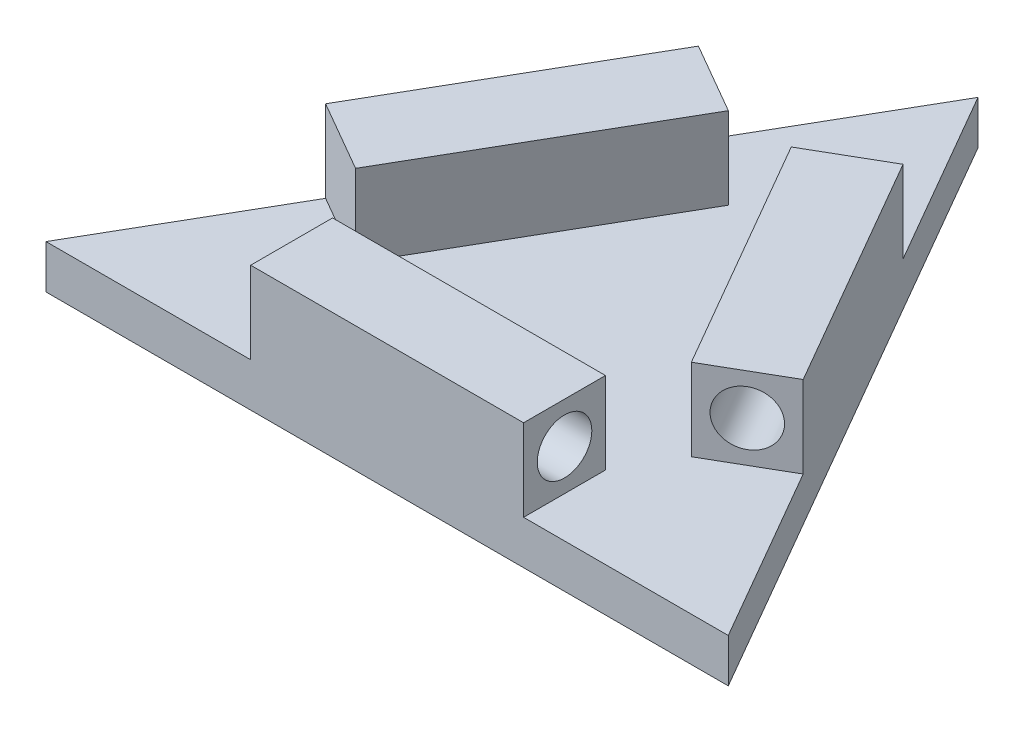
ISO-10303-21;
HEADER;
FILE_DESCRIPTION(('STEP AP214'),'2;1');
FILE_NAME('part.step','',(''),(''),'','','');
FILE_SCHEMA(('AUTOMOTIVE_DESIGN { 1 0 10303 214 1 1 1 1 }'));
ENDSEC;
DATA;
#1=APPLICATION_CONTEXT('core data for automotive mechanical design processes');
#2=APPLICATION_PROTOCOL_DEFINITION('international standard','automotive_design',2000,#1);
#3=PRODUCT_CONTEXT('',#1,'mechanical');
#4=PRODUCT('Part','Part','',(#3));
#5=PRODUCT_RELATED_PRODUCT_CATEGORY('part','',(#4));
#6=PRODUCT_DEFINITION_FORMATION('','',#4);
#7=PRODUCT_DEFINITION_CONTEXT('part definition',#1,'design');
#8=PRODUCT_DEFINITION('design','',#6,#7);
#9=PRODUCT_DEFINITION_SHAPE('','',#8);
#10=(LENGTH_UNIT() NAMED_UNIT(*) SI_UNIT(.MILLI.,.METRE.));
#11=(NAMED_UNIT(*) PLANE_ANGLE_UNIT() SI_UNIT($,.RADIAN.));
#12=(NAMED_UNIT(*) SI_UNIT($,.STERADIAN.) SOLID_ANGLE_UNIT());
#13=UNCERTAINTY_MEASURE_WITH_UNIT(LENGTH_MEASURE(1.E-05),#10,'distance_accuracy_value','');
#14=(GEOMETRIC_REPRESENTATION_CONTEXT(3) GLOBAL_UNCERTAINTY_ASSIGNED_CONTEXT((#13)) GLOBAL_UNIT_ASSIGNED_CONTEXT((#10,
#11,#12)) REPRESENTATION_CONTEXT('',''));
#15=CARTESIAN_POINT('',(0.,0.,0.));
#16=DIRECTION('',(0.,0.,1.));
#17=DIRECTION('',(1.,0.,0.));
#18=AXIS2_PLACEMENT_3D('',#15,#16,#17);
#19=CARTESIAN_POINT('',(0.,8.,-54.1265877365274));
#20=DIRECTION('',(0.866025403784439,0.,0.5));
#21=DIRECTION('',(0.5,0.,-0.866025403784439));
#22=AXIS2_PLACEMENT_3D('',#19,#20,#21);
#23=PLANE('',#22);
#24=DIRECTION('',(-0.5,0.,0.866025403784439));
#25=VECTOR('',#24,1.);
#26=CARTESIAN_POINT('',(0.,0.,-54.1265877365274));
#27=LINE('',#26,#25);
#28=CARTESIAN_POINT('',(0.,0.,-54.1265877365274));
#29=VERTEX_POINT('',#28);
#30=CARTESIAN_POINT('',(-62.5,0.,54.1265877365274));
#31=VERTEX_POINT('',#30);
#32=EDGE_CURVE('E238',#29,#31,#27,.T.);
#33=ORIENTED_EDGE('',*,*,#32,.T.);
#34=DIRECTION('',(0.,-1.,0.));
#35=VECTOR('',#34,1.);
#36=CARTESIAN_POINT('',(-62.5,8.,54.1265877365274));
#37=LINE('',#36,#35);
#38=CARTESIAN_POINT('',(-62.5,8.,54.1265877365274));
#39=VERTEX_POINT('',#38);
#40=EDGE_CURVE('E11',#39,#31,#37,.T.);
#41=ORIENTED_EDGE('',*,*,#40,.F.);
#42=DIRECTION('',(-0.5,0.,0.866025403784439));
#43=VECTOR('',#42,1.);
#44=CARTESIAN_POINT('',(0.,8.,-54.1265877365274));
#45=LINE('',#44,#43);
#46=CARTESIAN_POINT('',(-43.75,8.,21.650635094611));
#47=VERTEX_POINT('',#46);
#48=EDGE_CURVE('E242',#47,#39,#45,.T.);
#49=ORIENTED_EDGE('',*,*,#48,.F.);
#50=DIRECTION('',(0.,-1.,0.));
#51=VECTOR('',#50,1.);
#52=CARTESIAN_POINT('',(-43.75,23.,21.650635094611));
#53=LINE('',#52,#51);
#54=CARTESIAN_POINT('',(-43.75,23.,21.650635094611));
#55=VERTEX_POINT('',#54);
#56=EDGE_CURVE('E184',#55,#47,#53,.T.);
#57=ORIENTED_EDGE('',*,*,#56,.F.);
#58=DIRECTION('',(-0.5,0.,0.866025403784439));
#59=VECTOR('',#58,1.);
#60=CARTESIAN_POINT('',(-18.75,23.,-21.650635094611));
#61=LINE('',#60,#59);
#62=CARTESIAN_POINT('',(-18.75,23.,-21.650635094611));
#63=VERTEX_POINT('',#62);
#64=EDGE_CURVE('E200',#63,#55,#61,.T.);
#65=ORIENTED_EDGE('',*,*,#64,.F.);
#66=DIRECTION('',(0.,-1.,0.));
#67=VECTOR('',#66,1.);
#68=CARTESIAN_POINT('',(-18.75,23.,-21.650635094611));
#69=LINE('',#68,#67);
#70=CARTESIAN_POINT('',(-18.75,8.,-21.650635094611));
#71=VERTEX_POINT('',#70);
#72=EDGE_CURVE('E194',#63,#71,#69,.T.);
#73=ORIENTED_EDGE('',*,*,#72,.T.);
#74=CARTESIAN_POINT('',(0.,8.,-54.1265877365274));
#75=VERTEX_POINT('',#74);
#76=EDGE_CURVE('E239',#75,#71,#45,.T.);
#77=ORIENTED_EDGE('',*,*,#76,.F.);
#78=DIRECTION('',(0.,-1.,0.));
#79=VECTOR('',#78,1.);
#80=CARTESIAN_POINT('',(0.,8.,-54.1265877365274));
#81=LINE('',#80,#79);
#82=EDGE_CURVE('E248',#75,#29,#81,.T.);
#83=ORIENTED_EDGE('',*,*,#82,.T.);
#84=EDGE_LOOP('',(#33,#41,#49,#57,#65,#73,#77,#83));
#85=FACE_BOUND('',#84,.T.);
#86=ADVANCED_FACE('F41',(#85),#23,.F.);
#87=CARTESIAN_POINT('',(-62.5,8.,54.1265877365274));
#88=DIRECTION('',(0.,0.,-1.));
#89=DIRECTION('',(-1.,0.,0.));
#90=AXIS2_PLACEMENT_3D('',#87,#88,#89);
#91=PLANE('',#90);
#92=DIRECTION('',(1.,0.,0.));
#93=VECTOR('',#92,1.);
#94=CARTESIAN_POINT('',(-62.5,0.,54.1265877365274));
#95=LINE('',#94,#93);
#96=CARTESIAN_POINT('',(62.5,0.,54.1265877365274));
#97=VERTEX_POINT('',#96);
#98=EDGE_CURVE('E251',#31,#97,#95,.T.);
#99=ORIENTED_EDGE('',*,*,#98,.T.);
#100=DIRECTION('',(0.,-1.,0.));
#101=VECTOR('',#100,1.);
#102=CARTESIAN_POINT('',(62.5,8.,54.1265877365274));
#103=LINE('',#102,#101);
#104=CARTESIAN_POINT('',(62.5,8.,54.1265877365274));
#105=VERTEX_POINT('',#104);
#106=EDGE_CURVE('E48',#105,#97,#103,.T.);
#107=ORIENTED_EDGE('',*,*,#106,.F.);
#108=DIRECTION('',(1.,0.,0.));
#109=VECTOR('',#108,1.);
#110=CARTESIAN_POINT('',(-62.5,8.,54.1265877365274));
#111=LINE('',#110,#109);
#112=CARTESIAN_POINT('',(25.,8.,54.1265877365274));
#113=VERTEX_POINT('',#112);
#114=EDGE_CURVE('E241',#113,#105,#111,.T.);
#115=ORIENTED_EDGE('',*,*,#114,.F.);
#116=DIRECTION('',(0.,-1.,0.));
#117=VECTOR('',#116,1.);
#118=CARTESIAN_POINT('',(25.,23.,54.1265877365274));
#119=LINE('',#118,#117);
#120=CARTESIAN_POINT('',(25.,23.,54.1265877365274));
#121=VERTEX_POINT('',#120);
#122=EDGE_CURVE('E161',#121,#113,#119,.T.);
#123=ORIENTED_EDGE('',*,*,#122,.F.);
#124=DIRECTION('',(1.,0.,0.));
#125=VECTOR('',#124,1.);
#126=CARTESIAN_POINT('',(-25.,23.,54.1265877365274));
#127=LINE('',#126,#125);
#128=CARTESIAN_POINT('',(-25.,23.,54.1265877365274));
#129=VERTEX_POINT('',#128);
#130=EDGE_CURVE('E177',#129,#121,#127,.T.);
#131=ORIENTED_EDGE('',*,*,#130,.F.);
#132=DIRECTION('',(0.,-1.,0.));
#133=VECTOR('',#132,1.);
#134=CARTESIAN_POINT('',(-25.,23.,54.1265877365274));
#135=LINE('',#134,#133);
#136=CARTESIAN_POINT('',(-25.,8.,54.1265877365274));
#137=VERTEX_POINT('',#136);
#138=EDGE_CURVE('E168',#129,#137,#135,.T.);
#139=ORIENTED_EDGE('',*,*,#138,.T.);
#140=EDGE_CURVE('E243',#39,#137,#111,.T.);
#141=ORIENTED_EDGE('',*,*,#140,.F.);
#142=ORIENTED_EDGE('',*,*,#40,.T.);
#143=EDGE_LOOP('',(#99,#107,#115,#123,#131,#139,#141,#142));
#144=FACE_BOUND('',#143,.T.);
#145=ADVANCED_FACE('F299',(#144),#91,.F.);
#146=CARTESIAN_POINT('',(62.5,8.,54.1265877365274));
#147=DIRECTION('',(-0.866025403784439,0.,0.5));
#148=DIRECTION('',(0.5,0.,0.866025403784439));
#149=AXIS2_PLACEMENT_3D('',#146,#147,#148);
#150=PLANE('',#149);
#151=DIRECTION('',(-0.5,0.,-0.866025403784439));
#152=VECTOR('',#151,1.);
#153=CARTESIAN_POINT('',(62.5,0.,54.1265877365274));
#154=LINE('',#153,#152);
#155=EDGE_CURVE('E253',#97,#29,#154,.T.);
#156=ORIENTED_EDGE('',*,*,#155,.T.);
#157=ORIENTED_EDGE('',*,*,#82,.F.);
#158=DIRECTION('',(-0.5,0.,-0.866025403784439));
#159=VECTOR('',#158,1.);
#160=CARTESIAN_POINT('',(62.5,8.,54.1265877365274));
#161=LINE('',#160,#159);
#162=CARTESIAN_POINT('',(18.75,8.,-21.650635094611));
#163=VERTEX_POINT('',#162);
#164=EDGE_CURVE('E245',#163,#75,#161,.T.);
#165=ORIENTED_EDGE('',*,*,#164,.F.);
#166=DIRECTION('',(0.,-1.,0.));
#167=VECTOR('',#166,1.);
#168=CARTESIAN_POINT('',(18.75,23.,-21.650635094611));
#169=LINE('',#168,#167);
#170=CARTESIAN_POINT('',(18.75,23.,-21.650635094611));
#171=VERTEX_POINT('',#170);
#172=EDGE_CURVE('E235',#171,#163,#169,.T.);
#173=ORIENTED_EDGE('',*,*,#172,.F.);
#174=DIRECTION('',(-0.5,0.,-0.866025403784439));
#175=VECTOR('',#174,1.);
#176=CARTESIAN_POINT('',(43.75,23.,21.650635094611));
#177=LINE('',#176,#175);
#178=CARTESIAN_POINT('',(43.75,23.,21.650635094611));
#179=VERTEX_POINT('',#178);
#180=EDGE_CURVE('E210',#179,#171,#177,.T.);
#181=ORIENTED_EDGE('',*,*,#180,.F.);
#182=DIRECTION('',(0.,-1.,0.));
#183=VECTOR('',#182,1.);
#184=CARTESIAN_POINT('',(43.75,23.,21.650635094611));
#185=LINE('',#184,#183);
#186=CARTESIAN_POINT('',(43.75,8.,21.650635094611));
#187=VERTEX_POINT('',#186);
#188=EDGE_CURVE('E219',#179,#187,#185,.T.);
#189=ORIENTED_EDGE('',*,*,#188,.T.);
#190=EDGE_CURVE('E246',#105,#187,#161,.T.);
#191=ORIENTED_EDGE('',*,*,#190,.F.);
#192=ORIENTED_EDGE('',*,*,#106,.T.);
#193=EDGE_LOOP('',(#156,#157,#165,#173,#181,#189,#191,#192));
#194=FACE_BOUND('',#193,.T.);
#195=ADVANCED_FACE('F261',(#194),#150,.F.);
#196=CARTESIAN_POINT('',(0.,8.,0.));
#197=DIRECTION('',(0.,1.,0.));
#198=DIRECTION('',(0.,0.,1.));
#199=AXIS2_PLACEMENT_3D('',#196,#197,#198);
#200=PLANE('',#199);
#201=DIRECTION('',(-0.866025403784438,0.,-0.5));
#202=VECTOR('',#201,1.);
#203=CARTESIAN_POINT('',(-5.75961894323342,8.,-14.150635094611));
#204=LINE('',#203,#202);
#205=CARTESIAN_POINT('',(-5.75961894323342,8.,-14.150635094611));
#206=VERTEX_POINT('',#205);
#207=EDGE_CURVE('E55',#206,#71,#204,.T.);
#208=ORIENTED_EDGE('',*,*,#207,.F.);
#209=DIRECTION('',(0.5,0.,-0.866025403784439));
#210=VECTOR('',#209,1.);
#211=CARTESIAN_POINT('',(-30.7596189432334,8.,29.150635094611));
#212=LINE('',#211,#210);
#213=CARTESIAN_POINT('',(-30.7596189432334,8.,29.150635094611));
#214=VERTEX_POINT('',#213);
#215=EDGE_CURVE('E199',#214,#206,#212,.T.);
#216=ORIENTED_EDGE('',*,*,#215,.F.);
#217=DIRECTION('',(0.866025403784439,0.,0.5));
#218=VECTOR('',#217,1.);
#219=CARTESIAN_POINT('',(-43.75,8.,21.650635094611));
#220=LINE('',#219,#218);
#221=EDGE_CURVE('E170',#47,#214,#220,.T.);
#222=ORIENTED_EDGE('',*,*,#221,.F.);
#223=ORIENTED_EDGE('',*,*,#48,.T.);
#224=ORIENTED_EDGE('',*,*,#140,.T.);
#225=DIRECTION('',(0.,0.,1.));
#226=VECTOR('',#225,1.);
#227=CARTESIAN_POINT('',(-25.,8.,39.1265877365274));
#228=LINE('',#227,#226);
#229=CARTESIAN_POINT('',(-25.,8.,39.1265877365274));
#230=VERTEX_POINT('',#229);
#231=EDGE_CURVE('E62',#230,#137,#228,.T.);
#232=ORIENTED_EDGE('',*,*,#231,.F.);
#233=DIRECTION('',(-1.,0.,0.));
#234=VECTOR('',#233,1.);
#235=CARTESIAN_POINT('',(25.,8.,39.1265877365274));
#236=LINE('',#235,#234);
#237=CARTESIAN_POINT('',(25.,8.,39.1265877365274));
#238=VERTEX_POINT('',#237);
#239=EDGE_CURVE('E143',#238,#230,#236,.T.);
#240=ORIENTED_EDGE('',*,*,#239,.F.);
#241=DIRECTION('',(0.,0.,-1.));
#242=VECTOR('',#241,1.);
#243=CARTESIAN_POINT('',(25.,8.,54.1265877365274));
#244=LINE('',#243,#242);
#245=EDGE_CURVE('E146',#113,#238,#244,.T.);
#246=ORIENTED_EDGE('',*,*,#245,.F.);
#247=ORIENTED_EDGE('',*,*,#114,.T.);
#248=ORIENTED_EDGE('',*,*,#190,.T.);
#249=DIRECTION('',(0.866025403784439,0.,-0.5));
#250=VECTOR('',#249,1.);
#251=CARTESIAN_POINT('',(30.7596189432334,8.,29.150635094611));
#252=LINE('',#251,#250);
#253=CARTESIAN_POINT('',(30.7596189432334,8.,29.150635094611));
#254=VERTEX_POINT('',#253);
#255=EDGE_CURVE('E213',#254,#187,#252,.T.);
#256=ORIENTED_EDGE('',*,*,#255,.F.);
#257=DIRECTION('',(0.5,0.,0.866025403784438));
#258=VECTOR('',#257,1.);
#259=CARTESIAN_POINT('',(5.75961894323342,8.,-14.150635094611));
#260=LINE('',#259,#258);
#261=CARTESIAN_POINT('',(5.75961894323342,8.,-14.150635094611));
#262=VERTEX_POINT('',#261);
#263=EDGE_CURVE('E222',#262,#254,#260,.T.);
#264=ORIENTED_EDGE('',*,*,#263,.F.);
#265=DIRECTION('',(-0.866025403784439,0.,0.5));
#266=VECTOR('',#265,1.);
#267=CARTESIAN_POINT('',(18.75,8.,-21.650635094611));
#268=LINE('',#267,#266);
#269=EDGE_CURVE('E162',#163,#262,#268,.T.);
#270=ORIENTED_EDGE('',*,*,#269,.F.);
#271=ORIENTED_EDGE('',*,*,#164,.T.);
#272=ORIENTED_EDGE('',*,*,#76,.T.);
#273=EDGE_LOOP('',(#208,#216,#222,#223,#224,#232,#240,#246,#247,#248,#256,#264,#270,#271,#272));
#274=FACE_BOUND('',#273,.T.);
#275=ADVANCED_FACE('F145',(#274),#200,.T.);
#276=CARTESIAN_POINT('',(0.,0.,0.));
#277=DIRECTION('',(0.,1.,0.));
#278=DIRECTION('',(0.,0.,1.));
#279=AXIS2_PLACEMENT_3D('',#276,#277,#278);
#280=PLANE('',#279);
#281=ORIENTED_EDGE('',*,*,#32,.F.);
#282=ORIENTED_EDGE('',*,*,#155,.F.);
#283=ORIENTED_EDGE('',*,*,#98,.F.);
#284=EDGE_LOOP('',(#281,#282,#283));
#285=FACE_BOUND('',#284,.T.);
#286=ADVANCED_FACE('F266',(#285),#280,.F.);
#287=CARTESIAN_POINT('',(18.75,23.,-21.650635094611));
#288=DIRECTION('',(0.5,0.,0.866025403784439));
#289=DIRECTION('',(0.866025403784439,0.,-0.5));
#290=AXIS2_PLACEMENT_3D('',#287,#288,#289);
#291=PLANE('',#290);
#292=ORIENTED_EDGE('',*,*,#269,.T.);
#293=DIRECTION('',(0.,-1.,0.));
#294=VECTOR('',#293,1.);
#295=CARTESIAN_POINT('',(5.75961894323342,23.,-14.150635094611));
#296=LINE('',#295,#294);
#297=CARTESIAN_POINT('',(5.75961894323342,23.,-14.150635094611));
#298=VERTEX_POINT('',#297);
#299=EDGE_CURVE('E232',#298,#262,#296,.T.);
#300=ORIENTED_EDGE('',*,*,#299,.F.);
#301=DIRECTION('',(-0.866025403784439,0.,0.5));
#302=VECTOR('',#301,1.);
#303=CARTESIAN_POINT('',(18.75,23.,-21.650635094611));
#304=LINE('',#303,#302);
#305=EDGE_CURVE('E212',#171,#298,#304,.T.);
#306=ORIENTED_EDGE('',*,*,#305,.F.);
#307=ORIENTED_EDGE('',*,*,#172,.T.);
#308=EDGE_LOOP('',(#292,#300,#306,#307));
#309=FACE_BOUND('',#308,.T.);
#310=ADVANCED_FACE('F276',(#309),#291,.F.);
#311=CARTESIAN_POINT('',(5.75961894323342,23.,-14.150635094611));
#312=DIRECTION('',(0.866025403784438,0.,-0.5));
#313=DIRECTION('',(-0.5,0.,-0.866025403784439));
#314=AXIS2_PLACEMENT_3D('',#311,#312,#313);
#315=PLANE('',#314);
#316=ORIENTED_EDGE('',*,*,#263,.T.);
#317=DIRECTION('',(0.,-1.,0.));
#318=VECTOR('',#317,1.);
#319=CARTESIAN_POINT('',(30.7596189432334,23.,29.150635094611));
#320=LINE('',#319,#318);
#321=CARTESIAN_POINT('',(30.7596189432334,23.,29.150635094611));
#322=VERTEX_POINT('',#321);
#323=EDGE_CURVE('E229',#322,#254,#320,.T.);
#324=ORIENTED_EDGE('',*,*,#323,.F.);
#325=DIRECTION('',(0.5,0.,0.866025403784438));
#326=VECTOR('',#325,1.);
#327=CARTESIAN_POINT('',(5.75961894323342,23.,-14.150635094611));
#328=LINE('',#327,#326);
#329=EDGE_CURVE('E215',#298,#322,#328,.T.);
#330=ORIENTED_EDGE('',*,*,#329,.F.);
#331=ORIENTED_EDGE('',*,*,#299,.T.);
#332=EDGE_LOOP('',(#316,#324,#330,#331));
#333=FACE_BOUND('',#332,.T.);
#334=ADVANCED_FACE('F287',(#333),#315,.F.);
#335=CARTESIAN_POINT('',(30.7596189432334,23.,29.150635094611));
#336=DIRECTION('',(-0.5,0.,-0.866025403784439));
#337=DIRECTION('',(-0.866025403784439,0.,0.5));
#338=AXIS2_PLACEMENT_3D('',#335,#336,#337);
#339=PLANE('',#338);
#340=CARTESIAN_POINT('',(37.2548094716167,15.5,25.400635094611));
#341=DIRECTION('',(0.5,0.,0.866025403784439));
#342=DIRECTION('',(0.866025403784439,0.,-0.5));
#343=AXIS2_PLACEMENT_3D('',#340,#341,#342);
#344=CIRCLE('',#343,5.);
#345=CARTESIAN_POINT('',(41.5849364905389,15.5,22.900635094611));
#346=VERTEX_POINT('',#345);
#347=EDGE_CURVE('E487',#346,#346,#344,.T.);
#348=ORIENTED_EDGE('',*,*,#347,.F.);
#349=EDGE_LOOP('',(#348));
#350=FACE_BOUND('',#349,.T.);
#351=ORIENTED_EDGE('',*,*,#255,.T.);
#352=ORIENTED_EDGE('',*,*,#188,.F.);
#353=DIRECTION('',(0.866025403784439,0.,-0.5));
#354=VECTOR('',#353,1.);
#355=CARTESIAN_POINT('',(30.7596189432334,23.,29.150635094611));
#356=LINE('',#355,#354);
#357=EDGE_CURVE('E217',#322,#179,#356,.T.);
#358=ORIENTED_EDGE('',*,*,#357,.F.);
#359=ORIENTED_EDGE('',*,*,#323,.T.);
#360=EDGE_LOOP('',(#351,#352,#358,#359));
#361=FACE_BOUND('',#360,.T.);
#362=ADVANCED_FACE('F285',(#350,#361),#339,.F.);
#363=CARTESIAN_POINT('',(0.,23.,0.));
#364=DIRECTION('',(0.,1.,0.));
#365=DIRECTION('',(0.,0.,1.));
#366=AXIS2_PLACEMENT_3D('',#363,#364,#365);
#367=PLANE('',#366);
#368=ORIENTED_EDGE('',*,*,#180,.T.);
#369=ORIENTED_EDGE('',*,*,#305,.T.);
#370=ORIENTED_EDGE('',*,*,#329,.T.);
#371=ORIENTED_EDGE('',*,*,#357,.T.);
#372=EDGE_LOOP('',(#368,#369,#370,#371));
#373=FACE_BOUND('',#372,.T.);
#374=ADVANCED_FACE('F280',(#373),#367,.T.);
#375=CARTESIAN_POINT('',(25.,23.,54.1265877365274));
#376=DIRECTION('',(-1.,0.,0.));
#377=DIRECTION('',(0.,0.,1.));
#378=AXIS2_PLACEMENT_3D('',#375,#376,#377);
#379=PLANE('',#378);
#380=CARTESIAN_POINT('',(25.,15.5,46.6265877365274));
#381=DIRECTION('',(1.,0.,0.));
#382=DIRECTION('',(0.,0.,-1.));
#383=AXIS2_PLACEMENT_3D('',#380,#381,#382);
#384=CIRCLE('',#383,5.);
#385=CARTESIAN_POINT('',(25.,15.5,41.6265877365274));
#386=VERTEX_POINT('',#385);
#387=EDGE_CURVE('E497',#386,#386,#384,.T.);
#388=ORIENTED_EDGE('',*,*,#387,.F.);
#389=EDGE_LOOP('',(#388));
#390=FACE_BOUND('',#389,.T.);
#391=ORIENTED_EDGE('',*,*,#245,.T.);
#392=DIRECTION('',(0.,-1.,0.));
#393=VECTOR('',#392,1.);
#394=CARTESIAN_POINT('',(25.,23.,39.1265877365274));
#395=LINE('',#394,#393);
#396=CARTESIAN_POINT('',(25.,23.,39.1265877365274));
#397=VERTEX_POINT('',#396);
#398=EDGE_CURVE('E158',#397,#238,#395,.T.);
#399=ORIENTED_EDGE('',*,*,#398,.F.);
#400=DIRECTION('',(0.,0.,-1.));
#401=VECTOR('',#400,1.);
#402=CARTESIAN_POINT('',(25.,23.,54.1265877365274));
#403=LINE('',#402,#401);
#404=EDGE_CURVE('E181',#121,#397,#403,.T.);
#405=ORIENTED_EDGE('',*,*,#404,.F.);
#406=ORIENTED_EDGE('',*,*,#122,.T.);
#407=EDGE_LOOP('',(#391,#399,#405,#406));
#408=FACE_BOUND('',#407,.T.);
#409=ADVANCED_FACE('F156',(#390,#408),#379,.F.);
#410=CARTESIAN_POINT('',(25.,23.,39.1265877365274));
#411=DIRECTION('',(0.,0.,1.));
#412=DIRECTION('',(1.,0.,0.));
#413=AXIS2_PLACEMENT_3D('',#410,#411,#412);
#414=PLANE('',#413);
#415=ORIENTED_EDGE('',*,*,#239,.T.);
#416=DIRECTION('',(0.,-1.,0.));
#417=VECTOR('',#416,1.);
#418=CARTESIAN_POINT('',(-25.,23.,39.1265877365274));
#419=LINE('',#418,#417);
#420=CARTESIAN_POINT('',(-25.,23.,39.1265877365274));
#421=VERTEX_POINT('',#420);
#422=EDGE_CURVE('E166',#421,#230,#419,.T.);
#423=ORIENTED_EDGE('',*,*,#422,.F.);
#424=DIRECTION('',(-1.,0.,0.));
#425=VECTOR('',#424,1.);
#426=CARTESIAN_POINT('',(25.,23.,39.1265877365274));
#427=LINE('',#426,#425);
#428=EDGE_CURVE('E165',#397,#421,#427,.T.);
#429=ORIENTED_EDGE('',*,*,#428,.F.);
#430=ORIENTED_EDGE('',*,*,#398,.T.);
#431=EDGE_LOOP('',(#415,#423,#429,#430));
#432=FACE_BOUND('',#431,.T.);
#433=ADVANCED_FACE('F164',(#432),#414,.F.);
#434=CARTESIAN_POINT('',(-25.,23.,39.1265877365274));
#435=DIRECTION('',(1.,0.,0.));
#436=DIRECTION('',(0.,0.,-1.));
#437=AXIS2_PLACEMENT_3D('',#434,#435,#436);
#438=PLANE('',#437);
#439=ORIENTED_EDGE('',*,*,#231,.T.);
#440=ORIENTED_EDGE('',*,*,#138,.F.);
#441=DIRECTION('',(0.,0.,1.));
#442=VECTOR('',#441,1.);
#443=CARTESIAN_POINT('',(-25.,23.,39.1265877365274));
#444=LINE('',#443,#442);
#445=EDGE_CURVE('E176',#421,#129,#444,.T.);
#446=ORIENTED_EDGE('',*,*,#445,.F.);
#447=ORIENTED_EDGE('',*,*,#422,.T.);
#448=EDGE_LOOP('',(#439,#440,#446,#447));
#449=FACE_BOUND('',#448,.T.);
#450=ADVANCED_FACE('F366',(#449),#438,.F.);
#451=CARTESIAN_POINT('',(0.,23.,0.));
#452=DIRECTION('',(0.,1.,0.));
#453=DIRECTION('',(0.,0.,1.));
#454=AXIS2_PLACEMENT_3D('',#451,#452,#453);
#455=PLANE('',#454);
#456=ORIENTED_EDGE('',*,*,#130,.T.);
#457=ORIENTED_EDGE('',*,*,#404,.T.);
#458=ORIENTED_EDGE('',*,*,#428,.T.);
#459=ORIENTED_EDGE('',*,*,#445,.T.);
#460=EDGE_LOOP('',(#456,#457,#458,#459));
#461=FACE_BOUND('',#460,.T.);
#462=ADVANCED_FACE('F375',(#461),#455,.T.);
#463=CARTESIAN_POINT('',(-43.75,23.,21.650635094611));
#464=DIRECTION('',(0.5,0.,-0.866025403784439));
#465=DIRECTION('',(-0.866025403784439,0.,-0.5));
#466=AXIS2_PLACEMENT_3D('',#463,#464,#465);
#467=PLANE('',#466);
#468=ORIENTED_EDGE('',*,*,#221,.T.);
#469=DIRECTION('',(0.,-1.,0.));
#470=VECTOR('',#469,1.);
#471=CARTESIAN_POINT('',(-30.7596189432334,23.,29.150635094611));
#472=LINE('',#471,#470);
#473=CARTESIAN_POINT('',(-30.7596189432334,23.,29.150635094611));
#474=VERTEX_POINT('',#473);
#475=EDGE_CURVE('E187',#474,#214,#472,.T.);
#476=ORIENTED_EDGE('',*,*,#475,.F.);
#477=DIRECTION('',(0.866025403784439,0.,0.5));
#478=VECTOR('',#477,1.);
#479=CARTESIAN_POINT('',(-43.75,23.,21.650635094611));
#480=LINE('',#479,#478);
#481=EDGE_CURVE('E207',#55,#474,#480,.T.);
#482=ORIENTED_EDGE('',*,*,#481,.F.);
#483=ORIENTED_EDGE('',*,*,#56,.T.);
#484=EDGE_LOOP('',(#468,#476,#482,#483));
#485=FACE_BOUND('',#484,.T.);
#486=ADVANCED_FACE('F385',(#485),#467,.F.);
#487=CARTESIAN_POINT('',(-30.7596189432334,23.,29.150635094611));
#488=DIRECTION('',(-0.866025403784439,0.,-0.5));
#489=DIRECTION('',(-0.5,0.,0.866025403784439));
#490=AXIS2_PLACEMENT_3D('',#487,#488,#489);
#491=PLANE('',#490);
#492=ORIENTED_EDGE('',*,*,#215,.T.);
#493=DIRECTION('',(0.,-1.,0.));
#494=VECTOR('',#493,1.);
#495=CARTESIAN_POINT('',(-5.75961894323342,23.,-14.150635094611));
#496=LINE('',#495,#494);
#497=CARTESIAN_POINT('',(-5.75961894323342,23.,-14.150635094611));
#498=VERTEX_POINT('',#497);
#499=EDGE_CURVE('E191',#498,#206,#496,.T.);
#500=ORIENTED_EDGE('',*,*,#499,.F.);
#501=DIRECTION('',(0.5,0.,-0.866025403784439));
#502=VECTOR('',#501,1.);
#503=CARTESIAN_POINT('',(-30.7596189432334,23.,29.150635094611));
#504=LINE('',#503,#502);
#505=EDGE_CURVE('E205',#474,#498,#504,.T.);
#506=ORIENTED_EDGE('',*,*,#505,.F.);
#507=ORIENTED_EDGE('',*,*,#475,.T.);
#508=EDGE_LOOP('',(#492,#500,#506,#507));
#509=FACE_BOUND('',#508,.T.);
#510=ADVANCED_FACE('F395',(#509),#491,.F.);
#511=CARTESIAN_POINT('',(-5.75961894323342,23.,-14.150635094611));
#512=DIRECTION('',(-0.5,0.,0.866025403784439));
#513=DIRECTION('',(0.866025403784439,0.,0.5));
#514=AXIS2_PLACEMENT_3D('',#511,#512,#513);
#515=PLANE('',#514);
#516=CARTESIAN_POINT('',(-12.2548094716167,15.5,-17.900635094611));
#517=DIRECTION('',(0.5,0.,-0.866025403784438));
#518=DIRECTION('',(-0.866025403784439,0.,-0.5));
#519=AXIS2_PLACEMENT_3D('',#516,#517,#518);
#520=CIRCLE('',#519,5.);
#521=CARTESIAN_POINT('',(-16.5849364905389,15.5,-20.400635094611));
#522=VERTEX_POINT('',#521);
#523=EDGE_CURVE('E488',#522,#522,#520,.T.);
#524=ORIENTED_EDGE('',*,*,#523,.F.);
#525=EDGE_LOOP('',(#524));
#526=FACE_BOUND('',#525,.T.);
#527=ORIENTED_EDGE('',*,*,#207,.T.);
#528=ORIENTED_EDGE('',*,*,#72,.F.);
#529=DIRECTION('',(-0.866025403784438,0.,-0.5));
#530=VECTOR('',#529,1.);
#531=CARTESIAN_POINT('',(-5.75961894323342,23.,-14.150635094611));
#532=LINE('',#531,#530);
#533=EDGE_CURVE('E197',#498,#63,#532,.T.);
#534=ORIENTED_EDGE('',*,*,#533,.F.);
#535=ORIENTED_EDGE('',*,*,#499,.T.);
#536=EDGE_LOOP('',(#527,#528,#534,#535));
#537=FACE_BOUND('',#536,.T.);
#538=ADVANCED_FACE('F405',(#526,#537),#515,.F.);
#539=CARTESIAN_POINT('',(0.,23.,0.));
#540=DIRECTION('',(0.,1.,0.));
#541=DIRECTION('',(0.,0.,1.));
#542=AXIS2_PLACEMENT_3D('',#539,#540,#541);
#543=PLANE('',#542);
#544=ORIENTED_EDGE('',*,*,#64,.T.);
#545=ORIENTED_EDGE('',*,*,#481,.T.);
#546=ORIENTED_EDGE('',*,*,#505,.T.);
#547=ORIENTED_EDGE('',*,*,#533,.T.);
#548=EDGE_LOOP('',(#544,#545,#546,#547));
#549=FACE_BOUND('',#548,.T.);
#550=ADVANCED_FACE('F415',(#549),#543,.T.);
#551=CARTESIAN_POINT('',(-15.,15.5,46.6265877365274));
#552=DIRECTION('',(1.,0.,0.));
#553=DIRECTION('',(0.,0.,-1.));
#554=AXIS2_PLACEMENT_3D('',#551,#552,#553);
#555=CYLINDRICAL_SURFACE('',#554,5.);
#556=CARTESIAN_POINT('',(-15.,15.5,46.6265877365274));
#557=DIRECTION('',(1.,0.,0.));
#558=DIRECTION('',(0.,0.,-1.));
#559=AXIS2_PLACEMENT_3D('',#556,#557,#558);
#560=CIRCLE('',#559,5.);
#561=CARTESIAN_POINT('',(-15.,15.5,41.6265877365274));
#562=VERTEX_POINT('',#561);
#563=EDGE_CURVE('E188',#562,#562,#560,.T.);
#564=ORIENTED_EDGE('',*,*,#563,.F.);
#565=EDGE_LOOP('',(#564));
#566=FACE_BOUND('',#565,.T.);
#567=ORIENTED_EDGE('',*,*,#387,.T.);
#568=EDGE_LOOP('',(#567));
#569=FACE_BOUND('',#568,.T.);
#570=ADVANCED_FACE('F426',(#566,#569),#555,.F.);
#571=CARTESIAN_POINT('',(-15.,15.5,46.6265877365274));
#572=DIRECTION('',(1.,0.,0.));
#573=DIRECTION('',(0.,0.,-1.));
#574=AXIS2_PLACEMENT_3D('',#571,#572,#573);
#575=PLANE('',#574);
#576=ORIENTED_EDGE('',*,*,#563,.T.);
#577=EDGE_LOOP('',(#576));
#578=FACE_BOUND('',#577,.T.);
#579=ADVANCED_FACE('F435',(#578),#575,.T.);
#580=CARTESIAN_POINT('',(17.2548094716167,15.5,-9.24038105676656));
#581=DIRECTION('',(0.5,0.,0.866025403784439));
#582=DIRECTION('',(0.866025403784439,0.,-0.5));
#583=AXIS2_PLACEMENT_3D('',#580,#581,#582);
#584=CYLINDRICAL_SURFACE('',#583,5.);
#585=CARTESIAN_POINT('',(17.2548094716167,15.5,-9.24038105676656));
#586=DIRECTION('',(0.5,0.,0.866025403784439));
#587=DIRECTION('',(0.866025403784439,0.,-0.5));
#588=AXIS2_PLACEMENT_3D('',#585,#586,#587);
#589=CIRCLE('',#588,5.);
#590=CARTESIAN_POINT('',(21.5849364905389,15.5,-11.7403810567666));
#591=VERTEX_POINT('',#590);
#592=EDGE_CURVE('E491',#591,#591,#589,.T.);
#593=ORIENTED_EDGE('',*,*,#592,.F.);
#594=EDGE_LOOP('',(#593));
#595=FACE_BOUND('',#594,.T.);
#596=ORIENTED_EDGE('',*,*,#347,.T.);
#597=EDGE_LOOP('',(#596));
#598=FACE_BOUND('',#597,.T.);
#599=ADVANCED_FACE('F444',(#595,#598),#584,.F.);
#600=CARTESIAN_POINT('',(17.2548094716167,15.5,-9.24038105676656));
#601=DIRECTION('',(0.5,0.,0.866025403784439));
#602=DIRECTION('',(0.866025403784439,0.,-0.5));
#603=AXIS2_PLACEMENT_3D('',#600,#601,#602);
#604=PLANE('',#603);
#605=ORIENTED_EDGE('',*,*,#592,.T.);
#606=EDGE_LOOP('',(#605));
#607=FACE_BOUND('',#606,.T.);
#608=ADVANCED_FACE('F453',(#607),#604,.T.);
#609=CARTESIAN_POINT('',(-32.2548094716167,15.5,16.7403810567666));
#610=DIRECTION('',(0.5,0.,-0.866025403784438));
#611=DIRECTION('',(-0.866025403784439,0.,-0.5));
#612=AXIS2_PLACEMENT_3D('',#609,#610,#611);
#613=CYLINDRICAL_SURFACE('',#612,5.);
#614=CARTESIAN_POINT('',(-32.2548094716167,15.5,16.7403810567666));
#615=DIRECTION('',(0.5,0.,-0.866025403784438));
#616=DIRECTION('',(-0.866025403784439,0.,-0.5));
#617=AXIS2_PLACEMENT_3D('',#614,#615,#616);
#618=CIRCLE('',#617,5.);
#619=CARTESIAN_POINT('',(-36.5849364905389,15.5,14.2403810567666));
#620=VERTEX_POINT('',#619);
#621=EDGE_CURVE('E486',#620,#620,#618,.T.);
#622=ORIENTED_EDGE('',*,*,#621,.F.);
#623=EDGE_LOOP('',(#622));
#624=FACE_BOUND('',#623,.T.);
#625=ORIENTED_EDGE('',*,*,#523,.T.);
#626=EDGE_LOOP('',(#625));
#627=FACE_BOUND('',#626,.T.);
#628=ADVANCED_FACE('F462',(#624,#627),#613,.F.);
#629=CARTESIAN_POINT('',(-32.2548094716167,15.5,16.7403810567666));
#630=DIRECTION('',(0.5,0.,-0.866025403784438));
#631=DIRECTION('',(-0.866025403784439,0.,-0.5));
#632=AXIS2_PLACEMENT_3D('',#629,#630,#631);
#633=PLANE('',#632);
#634=ORIENTED_EDGE('',*,*,#621,.T.);
#635=EDGE_LOOP('',(#634));
#636=FACE_BOUND('',#635,.T.);
#637=ADVANCED_FACE('F471',(#636),#633,.T.);
#638=CLOSED_SHELL('',(#86,#145,#195,#275,#286,#310,#334,#362,#374,#409,#433,#450,#462,#486,#510,
#538,#550,#570,#579,#599,#608,#628,#637));
#639=MANIFOLD_SOLID_BREP('B2',#638);
#640=ADVANCED_BREP_SHAPE_REPRESENTATION('',(#18,#639),#14);
#641=SHAPE_DEFINITION_REPRESENTATION(#9,#640);
ENDSEC;
END-ISO-10303-21;
